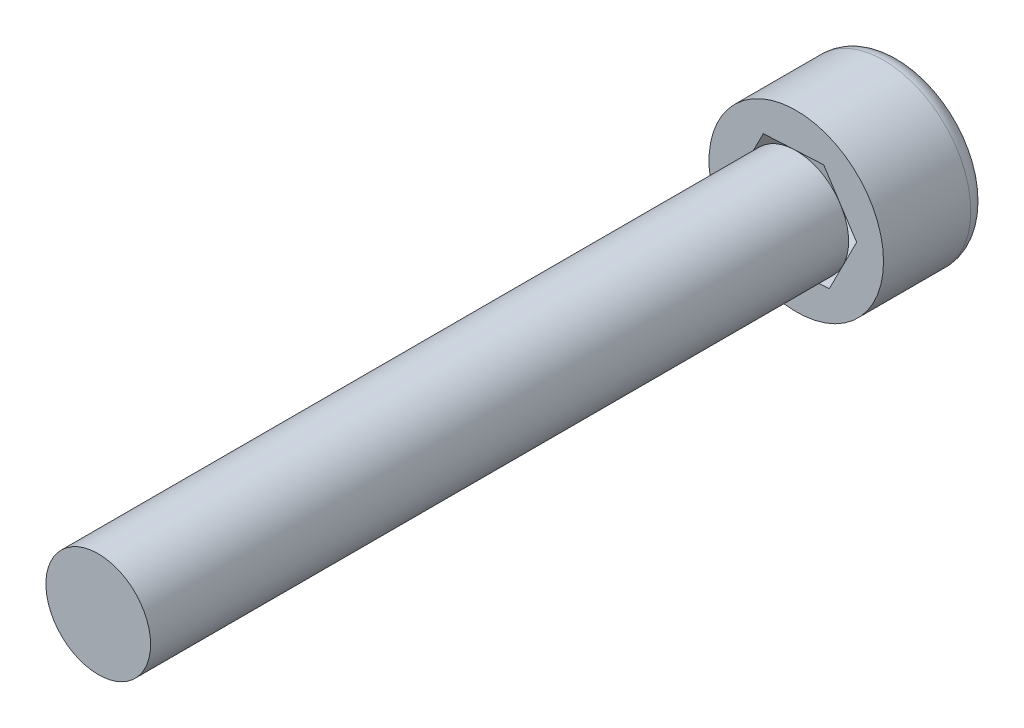
ISO-10303-21;
HEADER;
FILE_DESCRIPTION(('STEP AP214'),'2;1');
FILE_NAME('part.step','',(''),(''),'','','');
FILE_SCHEMA(('AUTOMOTIVE_DESIGN { 1 0 10303 214 1 1 1 1 }'));
ENDSEC;
DATA;
#1=APPLICATION_CONTEXT('core data for automotive mechanical design processes');
#2=APPLICATION_PROTOCOL_DEFINITION('international standard','automotive_design',2000,#1);
#3=PRODUCT_CONTEXT('',#1,'mechanical');
#4=PRODUCT('Part','Part','',(#3));
#5=PRODUCT_RELATED_PRODUCT_CATEGORY('part','',(#4));
#6=PRODUCT_DEFINITION_FORMATION('','',#4);
#7=PRODUCT_DEFINITION_CONTEXT('part definition',#1,'design');
#8=PRODUCT_DEFINITION('design','',#6,#7);
#9=PRODUCT_DEFINITION_SHAPE('','',#8);
#10=(LENGTH_UNIT() NAMED_UNIT(*) SI_UNIT(.MILLI.,.METRE.));
#11=(NAMED_UNIT(*) PLANE_ANGLE_UNIT() SI_UNIT($,.RADIAN.));
#12=(NAMED_UNIT(*) SI_UNIT($,.STERADIAN.) SOLID_ANGLE_UNIT());
#13=UNCERTAINTY_MEASURE_WITH_UNIT(LENGTH_MEASURE(1.E-05),#10,'distance_accuracy_value','');
#14=(GEOMETRIC_REPRESENTATION_CONTEXT(3) GLOBAL_UNCERTAINTY_ASSIGNED_CONTEXT((#13)) GLOBAL_UNIT_ASSIGNED_CONTEXT((#10,
#11,#12)) REPRESENTATION_CONTEXT('',''));
#15=CARTESIAN_POINT('',(0.,0.,0.));
#16=DIRECTION('',(0.,0.,1.));
#17=DIRECTION('',(1.,0.,0.));
#18=AXIS2_PLACEMENT_3D('',#15,#16,#17);
#19=CARTESIAN_POINT('',(0.,0.,3.));
#20=DIRECTION('',(0.,0.,-1.));
#21=DIRECTION('',(-1.,0.,0.));
#22=AXIS2_PLACEMENT_3D('',#19,#20,#21);
#23=CYLINDRICAL_SURFACE('',#22,2.5);
#24=CARTESIAN_POINT('',(0.,0.,0.5));
#25=DIRECTION('',(0.,0.,1.));
#26=DIRECTION('',(1.,0.,0.));
#27=AXIS2_PLACEMENT_3D('',#24,#25,#26);
#28=CIRCLE('',#27,2.5);
#29=CARTESIAN_POINT('',(2.5,0.,0.5));
#30=VERTEX_POINT('',#29);
#31=EDGE_CURVE('E49',#30,#30,#28,.T.);
#32=ORIENTED_EDGE('',*,*,#31,.T.);
#33=EDGE_LOOP('',(#32));
#34=FACE_BOUND('',#33,.T.);
#35=CARTESIAN_POINT('',(0.,0.,3.));
#36=DIRECTION('',(0.,0.,1.));
#37=DIRECTION('',(1.,0.,0.));
#38=AXIS2_PLACEMENT_3D('',#35,#36,#37);
#39=CIRCLE('',#38,2.5);
#40=CARTESIAN_POINT('',(2.5,0.,3.));
#41=VERTEX_POINT('',#40);
#42=EDGE_CURVE('E164',#41,#41,#39,.T.);
#43=ORIENTED_EDGE('',*,*,#42,.F.);
#44=EDGE_LOOP('',(#43));
#45=FACE_BOUND('',#44,.T.);
#46=ADVANCED_FACE('F40',(#34,#45),#23,.T.);
#47=CARTESIAN_POINT('',(0.,0.,3.));
#48=DIRECTION('',(0.,0.,1.));
#49=DIRECTION('',(1.,0.,0.));
#50=AXIS2_PLACEMENT_3D('',#47,#48,#49);
#51=PLANE('',#50);
#52=DIRECTION('',(-0.998565318577122,-0.0535472178079434,0.));
#53=VECTOR('',#52,1.);
#54=CARTESIAN_POINT('',(0.945103759937804,-1.45147472694203,3.));
#55=LINE('',#54,#53);
#56=CARTESIAN_POINT('',(0.945103759937804,-1.45147472694203,3.));
#57=VERTEX_POINT('',#56);
#58=CARTESIAN_POINT('',(-0.784462106513973,-1.54422122878934,3.));
#59=VERTEX_POINT('',#58);
#60=EDGE_CURVE('E93',#57,#59,#55,.T.);
#61=ORIENTED_EDGE('',*,*,#60,.T.);
#62=DIRECTION('',(-0.545655910212218,0.838009324321917,0.));
#63=VECTOR('',#62,1.);
#64=CARTESIAN_POINT('',(-0.784462106513973,-1.54422122878934,3.));
#65=LINE('',#64,#63);
#66=CARTESIAN_POINT('',(-1.72956586645178,-0.0927465018473138,3.));
#67=VERTEX_POINT('',#66);
#68=EDGE_CURVE('E56',#59,#67,#65,.T.);
#69=ORIENTED_EDGE('',*,*,#68,.T.);
#70=DIRECTION('',(0.452909408364904,0.89155654212986,0.));
#71=VECTOR('',#70,1.);
#72=CARTESIAN_POINT('',(-1.72956586645178,-0.0927465018473138,3.));
#73=LINE('',#72,#71);
#74=CARTESIAN_POINT('',(-0.945103759937803,1.45147472694203,3.));
#75=VERTEX_POINT('',#74);
#76=EDGE_CURVE('E103',#67,#75,#73,.T.);
#77=ORIENTED_EDGE('',*,*,#76,.T.);
#78=DIRECTION('',(0.998565318577122,0.0535472178079431,0.));
#79=VECTOR('',#78,1.);
#80=CARTESIAN_POINT('',(-0.945103759937803,1.45147472694203,3.));
#81=LINE('',#80,#79);
#82=CARTESIAN_POINT('',(0.784462106513974,1.54422122878934,3.));
#83=VERTEX_POINT('',#82);
#84=EDGE_CURVE('E175',#75,#83,#81,.T.);
#85=ORIENTED_EDGE('',*,*,#84,.T.);
#86=DIRECTION('',(0.545655910212218,-0.838009324321917,0.));
#87=VECTOR('',#86,1.);
#88=CARTESIAN_POINT('',(0.784462106513974,1.54422122878934,3.));
#89=LINE('',#88,#87);
#90=CARTESIAN_POINT('',(1.72956586645178,0.0927465018473145,3.));
#91=VERTEX_POINT('',#90);
#92=EDGE_CURVE('E173',#83,#91,#89,.T.);
#93=ORIENTED_EDGE('',*,*,#92,.T.);
#94=DIRECTION('',(-0.452909408364904,-0.89155654212986,0.));
#95=VECTOR('',#94,1.);
#96=CARTESIAN_POINT('',(1.72956586645178,0.0927465018473145,3.));
#97=LINE('',#96,#95);
#98=EDGE_CURVE('E108',#91,#57,#97,.T.);
#99=ORIENTED_EDGE('',*,*,#98,.T.);
#100=EDGE_LOOP('',(#61,#69,#77,#85,#93,#99));
#101=FACE_BOUND('',#100,.T.);
#102=ORIENTED_EDGE('',*,*,#42,.T.);
#103=EDGE_LOOP('',(#102));
#104=FACE_BOUND('',#103,.T.);
#105=ADVANCED_FACE('F105',(#101,#104),#51,.T.);
#106=CARTESIAN_POINT('',(0.,0.,0.));
#107=DIRECTION('',(0.,0.,1.));
#108=DIRECTION('',(1.,0.,0.));
#109=AXIS2_PLACEMENT_3D('',#106,#107,#108);
#110=PLANE('',#109);
#111=CARTESIAN_POINT('',(0.,0.,0.));
#112=DIRECTION('',(0.,0.,1.));
#113=DIRECTION('',(1.,0.,0.));
#114=AXIS2_PLACEMENT_3D('',#111,#112,#113);
#115=CIRCLE('',#114,2.);
#116=CARTESIAN_POINT('',(2.,0.,0.));
#117=VERTEX_POINT('',#116);
#118=EDGE_CURVE('E12',#117,#117,#115,.F.);
#119=ORIENTED_EDGE('',*,*,#118,.T.);
#120=EDGE_LOOP('',(#119));
#121=FACE_BOUND('',#120,.T.);
#122=DIRECTION('',(-0.545655910212218,0.838009324321917,0.));
#123=VECTOR('',#122,1.);
#124=CARTESIAN_POINT('',(-0.784462106513973,-1.54422122878934,0.));
#125=LINE('',#124,#123);
#126=CARTESIAN_POINT('',(-0.784462106513973,-1.54422122878934,0.));
#127=VERTEX_POINT('',#126);
#128=CARTESIAN_POINT('',(-1.72956586645178,-0.0927465018473138,0.));
#129=VERTEX_POINT('',#128);
#130=EDGE_CURVE('E98',#127,#129,#125,.T.);
#131=ORIENTED_EDGE('',*,*,#130,.F.);
#132=DIRECTION('',(-0.998565318577122,-0.0535472178079434,0.));
#133=VECTOR('',#132,1.);
#134=CARTESIAN_POINT('',(0.945103759937804,-1.45147472694203,0.));
#135=LINE('',#134,#133);
#136=CARTESIAN_POINT('',(0.945103759937804,-1.45147472694203,0.));
#137=VERTEX_POINT('',#136);
#138=EDGE_CURVE('E89',#137,#127,#135,.T.);
#139=ORIENTED_EDGE('',*,*,#138,.F.);
#140=DIRECTION('',(-0.452909408364904,-0.89155654212986,0.));
#141=VECTOR('',#140,1.);
#142=CARTESIAN_POINT('',(1.72956586645178,0.0927465018473145,0.));
#143=LINE('',#142,#141);
#144=CARTESIAN_POINT('',(1.72956586645178,0.0927465018473145,0.));
#145=VERTEX_POINT('',#144);
#146=EDGE_CURVE('E155',#145,#137,#143,.T.);
#147=ORIENTED_EDGE('',*,*,#146,.F.);
#148=DIRECTION('',(0.545655910212218,-0.838009324321917,0.));
#149=VECTOR('',#148,1.);
#150=CARTESIAN_POINT('',(0.784462106513974,1.54422122878934,0.));
#151=LINE('',#150,#149);
#152=CARTESIAN_POINT('',(0.784462106513974,1.54422122878934,0.));
#153=VERTEX_POINT('',#152);
#154=EDGE_CURVE('E188',#153,#145,#151,.T.);
#155=ORIENTED_EDGE('',*,*,#154,.F.);
#156=DIRECTION('',(0.998565318577122,0.0535472178079431,0.));
#157=VECTOR('',#156,1.);
#158=CARTESIAN_POINT('',(-0.945103759937803,1.45147472694203,0.));
#159=LINE('',#158,#157);
#160=CARTESIAN_POINT('',(-0.945103759937803,1.45147472694203,0.));
#161=VERTEX_POINT('',#160);
#162=EDGE_CURVE('E184',#161,#153,#159,.T.);
#163=ORIENTED_EDGE('',*,*,#162,.F.);
#164=DIRECTION('',(0.452909408364904,0.89155654212986,0.));
#165=VECTOR('',#164,1.);
#166=CARTESIAN_POINT('',(-1.72956586645178,-0.0927465018473138,0.));
#167=LINE('',#166,#165);
#168=EDGE_CURVE('E181',#129,#161,#167,.T.);
#169=ORIENTED_EDGE('',*,*,#168,.F.);
#170=EDGE_LOOP('',(#131,#139,#147,#155,#163,#169));
#171=FACE_BOUND('',#170,.T.);
#172=ADVANCED_FACE('F130',(#121,#171),#110,.F.);
#173=CARTESIAN_POINT('',(0.945103759937804,-1.45147472694203,3.));
#174=DIRECTION('',(0.0535472178079434,-0.998565318577122,0.));
#175=DIRECTION('',(0.998565318577122,0.0535472178079434,0.));
#176=AXIS2_PLACEMENT_3D('',#173,#174,#175);
#177=PLANE('',#176);
#178=ORIENTED_EDGE('',*,*,#138,.T.);
#179=DIRECTION('',(0.,0.,-1.));
#180=VECTOR('',#179,1.);
#181=CARTESIAN_POINT('',(-0.784462106513973,-1.54422122878934,3.));
#182=LINE('',#181,#180);
#183=EDGE_CURVE('E91',#59,#127,#182,.T.);
#184=ORIENTED_EDGE('',*,*,#183,.F.);
#185=ORIENTED_EDGE('',*,*,#60,.F.);
#186=DIRECTION('',(0.,0.,-1.));
#187=VECTOR('',#186,1.);
#188=CARTESIAN_POINT('',(0.945103759937804,-1.45147472694203,3.));
#189=LINE('',#188,#187);
#190=EDGE_CURVE('E156',#57,#137,#189,.T.);
#191=ORIENTED_EDGE('',*,*,#190,.T.);
#192=EDGE_LOOP('',(#178,#184,#185,#191));
#193=FACE_BOUND('',#192,.T.);
#194=ADVANCED_FACE('F92',(#193),#177,.F.);
#195=CARTESIAN_POINT('',(1.72956586645178,0.0927465018473145,3.));
#196=DIRECTION('',(0.89155654212986,-0.452909408364904,0.));
#197=DIRECTION('',(0.452909408364904,0.89155654212986,0.));
#198=AXIS2_PLACEMENT_3D('',#195,#196,#197);
#199=PLANE('',#198);
#200=ORIENTED_EDGE('',*,*,#146,.T.);
#201=ORIENTED_EDGE('',*,*,#190,.F.);
#202=ORIENTED_EDGE('',*,*,#98,.F.);
#203=DIRECTION('',(0.,0.,-1.));
#204=VECTOR('',#203,1.);
#205=CARTESIAN_POINT('',(1.72956586645178,0.0927465018473145,3.));
#206=LINE('',#205,#204);
#207=EDGE_CURVE('E158',#91,#145,#206,.T.);
#208=ORIENTED_EDGE('',*,*,#207,.T.);
#209=EDGE_LOOP('',(#200,#201,#202,#208));
#210=FACE_BOUND('',#209,.T.);
#211=ADVANCED_FACE('F137',(#210),#199,.F.);
#212=CARTESIAN_POINT('',(0.784462106513974,1.54422122878934,3.));
#213=DIRECTION('',(0.838009324321917,0.545655910212218,0.));
#214=DIRECTION('',(-0.545655910212218,0.838009324321917,0.));
#215=AXIS2_PLACEMENT_3D('',#212,#213,#214);
#216=PLANE('',#215);
#217=ORIENTED_EDGE('',*,*,#154,.T.);
#218=ORIENTED_EDGE('',*,*,#207,.F.);
#219=ORIENTED_EDGE('',*,*,#92,.F.);
#220=DIRECTION('',(0.,0.,-1.));
#221=VECTOR('',#220,1.);
#222=CARTESIAN_POINT('',(0.784462106513974,1.54422122878934,3.));
#223=LINE('',#222,#221);
#224=EDGE_CURVE('E186',#83,#153,#223,.T.);
#225=ORIENTED_EDGE('',*,*,#224,.T.);
#226=EDGE_LOOP('',(#217,#218,#219,#225));
#227=FACE_BOUND('',#226,.T.);
#228=ADVANCED_FACE('F145',(#227),#216,.F.);
#229=CARTESIAN_POINT('',(-0.945103759937803,1.45147472694203,3.));
#230=DIRECTION('',(-0.0535472178079431,0.998565318577122,0.));
#231=DIRECTION('',(-0.998565318577122,-0.0535472178079432,0.));
#232=AXIS2_PLACEMENT_3D('',#229,#230,#231);
#233=PLANE('',#232);
#234=ORIENTED_EDGE('',*,*,#162,.T.);
#235=ORIENTED_EDGE('',*,*,#224,.F.);
#236=ORIENTED_EDGE('',*,*,#84,.F.);
#237=DIRECTION('',(0.,0.,-1.));
#238=VECTOR('',#237,1.);
#239=CARTESIAN_POINT('',(-0.945103759937803,1.45147472694203,3.));
#240=LINE('',#239,#238);
#241=EDGE_CURVE('E180',#75,#161,#240,.T.);
#242=ORIENTED_EDGE('',*,*,#241,.T.);
#243=EDGE_LOOP('',(#234,#235,#236,#242));
#244=FACE_BOUND('',#243,.T.);
#245=ADVANCED_FACE('F141',(#244),#233,.F.);
#246=CARTESIAN_POINT('',(-1.72956586645178,-0.0927465018473138,3.));
#247=DIRECTION('',(-0.89155654212986,0.452909408364904,0.));
#248=DIRECTION('',(-0.452909408364904,-0.89155654212986,0.));
#249=AXIS2_PLACEMENT_3D('',#246,#247,#248);
#250=PLANE('',#249);
#251=ORIENTED_EDGE('',*,*,#168,.T.);
#252=ORIENTED_EDGE('',*,*,#241,.F.);
#253=ORIENTED_EDGE('',*,*,#76,.F.);
#254=DIRECTION('',(0.,0.,-1.));
#255=VECTOR('',#254,1.);
#256=CARTESIAN_POINT('',(-1.72956586645178,-0.0927465018473138,3.));
#257=LINE('',#256,#255);
#258=EDGE_CURVE('E101',#67,#129,#257,.T.);
#259=ORIENTED_EDGE('',*,*,#258,.T.);
#260=EDGE_LOOP('',(#251,#252,#253,#259));
#261=FACE_BOUND('',#260,.T.);
#262=ADVANCED_FACE('F122',(#261),#250,.F.);
#263=CARTESIAN_POINT('',(-0.784462106513973,-1.54422122878934,3.));
#264=DIRECTION('',(-0.838009324321917,-0.545655910212218,0.));
#265=DIRECTION('',(0.545655910212218,-0.838009324321917,0.));
#266=AXIS2_PLACEMENT_3D('',#263,#264,#265);
#267=PLANE('',#266);
#268=ORIENTED_EDGE('',*,*,#130,.T.);
#269=ORIENTED_EDGE('',*,*,#258,.F.);
#270=ORIENTED_EDGE('',*,*,#68,.F.);
#271=ORIENTED_EDGE('',*,*,#183,.T.);
#272=EDGE_LOOP('',(#268,#269,#270,#271));
#273=FACE_BOUND('',#272,.T.);
#274=ADVANCED_FACE('F100',(#273),#267,.F.);
#275=CARTESIAN_POINT('',(0.,0.,0.5));
#276=DIRECTION('',(0.,0.,1.));
#277=DIRECTION('',(1.,0.,0.));
#278=AXIS2_PLACEMENT_3D('',#275,#276,#277);
#279=TOROIDAL_SURFACE('',#278,2.,0.5);
#280=ORIENTED_EDGE('',*,*,#118,.F.);
#281=EDGE_LOOP('',(#280));
#282=FACE_BOUND('',#281,.T.);
#283=ORIENTED_EDGE('',*,*,#31,.F.);
#284=EDGE_LOOP('',(#283));
#285=FACE_BOUND('',#284,.T.);
#286=ADVANCED_FACE('F42',(#282,#285),#279,.T.);
#287=CLOSED_SHELL('',(#46,#105,#172,#194,#211,#228,#245,#262,#274,#286));
#288=MANIFOLD_SOLID_BREP('B2',#287);
#289=CARTESIAN_POINT('',(0.,0.,23.));
#290=DIRECTION('',(0.,0.,1.));
#291=DIRECTION('',(1.,0.,0.));
#292=AXIS2_PLACEMENT_3D('',#289,#290,#291);
#293=PLANE('',#292);
#294=CARTESIAN_POINT('',(0.,0.,23.));
#295=DIRECTION('',(0.,0.,1.));
#296=DIRECTION('',(1.,0.,0.));
#297=AXIS2_PLACEMENT_3D('',#294,#295,#296);
#298=CIRCLE('',#297,1.5);
#299=CARTESIAN_POINT('',(1.5,0.,23.));
#300=VERTEX_POINT('',#299);
#301=EDGE_CURVE('E258',#300,#300,#298,.T.);
#302=ORIENTED_EDGE('',*,*,#301,.T.);
#303=EDGE_LOOP('',(#302));
#304=FACE_BOUND('',#303,.T.);
#305=ADVANCED_FACE('F251',(#304),#293,.T.);
#306=CARTESIAN_POINT('',(0.,0.,23.));
#307=DIRECTION('',(0.,0.,-1.));
#308=DIRECTION('',(-1.,0.,0.));
#309=AXIS2_PLACEMENT_3D('',#306,#307,#308);
#310=CYLINDRICAL_SURFACE('',#309,1.5);
#311=ORIENTED_EDGE('',*,*,#301,.F.);
#312=EDGE_LOOP('',(#311));
#313=FACE_BOUND('',#312,.T.);
#314=CARTESIAN_POINT('',(0.,0.,3.));
#315=DIRECTION('',(0.,0.,1.));
#316=DIRECTION('',(1.,0.,0.));
#317=AXIS2_PLACEMENT_3D('',#314,#315,#316);
#318=CIRCLE('',#317,1.5);
#319=CARTESIAN_POINT('',(1.5,0.,3.));
#320=VERTEX_POINT('',#319);
#321=EDGE_CURVE('E39',#320,#320,#318,.T.);
#322=ORIENTED_EDGE('',*,*,#321,.T.);
#323=EDGE_LOOP('',(#322));
#324=FACE_BOUND('',#323,.T.);
#325=ADVANCED_FACE('F253',(#313,#324),#310,.T.);
#326=CARTESIAN_POINT('',(0.,0.,3.));
#327=DIRECTION('',(0.,0.,-1.));
#328=DIRECTION('',(-1.,0.,0.));
#329=AXIS2_PLACEMENT_3D('',#326,#327,#328);
#330=PLANE('',#329);
#331=ORIENTED_EDGE('',*,*,#321,.F.);
#332=EDGE_LOOP('',(#331));
#333=FACE_BOUND('',#332,.T.);
#334=ADVANCED_FACE('F266',(#333),#330,.T.);
#335=CLOSED_SHELL('',(#305,#325,#334));
#336=MANIFOLD_SOLID_BREP('B6',#335);
#337=ADVANCED_BREP_SHAPE_REPRESENTATION('',(#18,#288,#336),#14);
#338=SHAPE_DEFINITION_REPRESENTATION(#9,#337);
ENDSEC;
END-ISO-10303-21;
